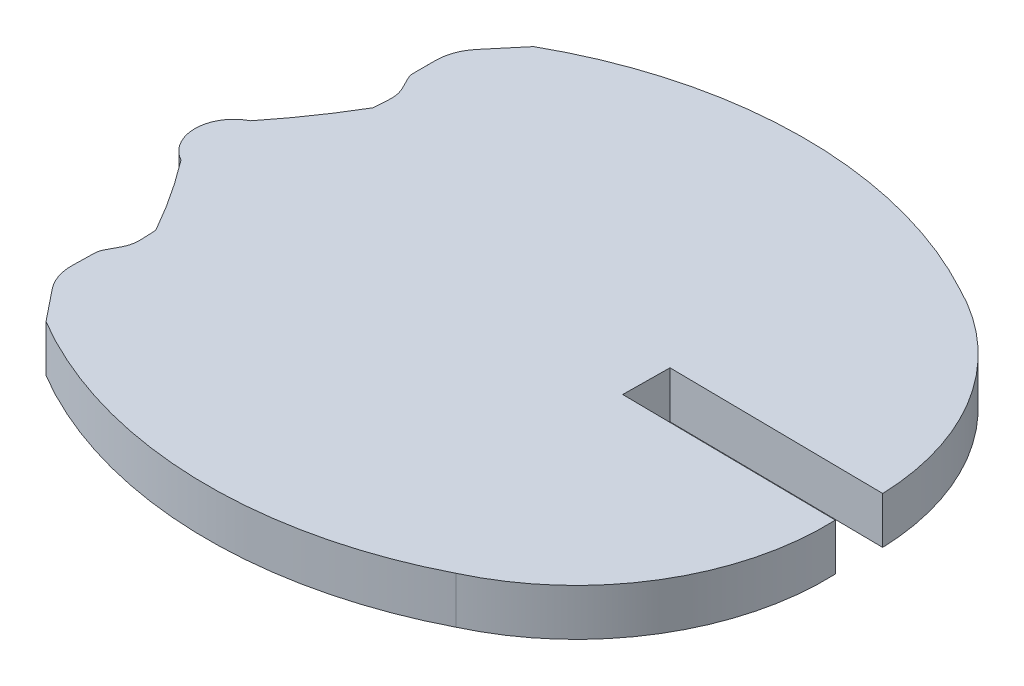
ISO-10303-21;
HEADER;
FILE_DESCRIPTION(('STEP AP214'),'2;1');
FILE_NAME('part.step','',(''),(''),'','','');
FILE_SCHEMA(('AUTOMOTIVE_DESIGN { 1 0 10303 214 1 1 1 1 }'));
ENDSEC;
DATA;
#1=APPLICATION_CONTEXT('core data for automotive mechanical design processes');
#2=APPLICATION_PROTOCOL_DEFINITION('international standard','automotive_design',2000,#1);
#3=PRODUCT_CONTEXT('',#1,'mechanical');
#4=PRODUCT('Part','Part','',(#3));
#5=PRODUCT_RELATED_PRODUCT_CATEGORY('part','',(#4));
#6=PRODUCT_DEFINITION_FORMATION('','',#4);
#7=PRODUCT_DEFINITION_CONTEXT('part definition',#1,'design');
#8=PRODUCT_DEFINITION('design','',#6,#7);
#9=PRODUCT_DEFINITION_SHAPE('','',#8);
#10=(LENGTH_UNIT() NAMED_UNIT(*) SI_UNIT(.MILLI.,.METRE.));
#11=(NAMED_UNIT(*) PLANE_ANGLE_UNIT() SI_UNIT($,.RADIAN.));
#12=(NAMED_UNIT(*) SI_UNIT($,.STERADIAN.) SOLID_ANGLE_UNIT());
#13=UNCERTAINTY_MEASURE_WITH_UNIT(LENGTH_MEASURE(1.E-05),#10,'distance_accuracy_value','');
#14=(GEOMETRIC_REPRESENTATION_CONTEXT(3) GLOBAL_UNCERTAINTY_ASSIGNED_CONTEXT((#13)) GLOBAL_UNIT_ASSIGNED_CONTEXT((#10,
#11,#12)) REPRESENTATION_CONTEXT('',''));
#15=CARTESIAN_POINT('',(0.,0.,0.));
#16=DIRECTION('',(0.,0.,1.));
#17=DIRECTION('',(1.,0.,0.));
#18=AXIS2_PLACEMENT_3D('',#15,#16,#17);
#19=CARTESIAN_POINT('',(-319.980883365397,2.,-506.984120103002));
#20=DIRECTION('',(0.,-1.,0.));
#21=DIRECTION('',(0.,0.,-1.));
#22=AXIS2_PLACEMENT_3D('',#19,#20,#21);
#23=CYLINDRICAL_SURFACE('',#22,18.7215126548);
#24=CARTESIAN_POINT('',(-319.980883365397,0.,-506.984120103002));
#25=DIRECTION('',(0.,1.,0.));
#26=DIRECTION('',(0.,0.,1.));
#27=AXIS2_PLACEMENT_3D('',#24,#25,#26);
#28=CIRCLE('',#27,18.7215126548);
#29=CARTESIAN_POINT('',(-329.52517,0.,-490.87817));
#30=VERTEX_POINT('',#29);
#31=CARTESIAN_POINT('',(-311.439430000059,0.,-490.324630000012));
#32=VERTEX_POINT('',#31);
#33=EDGE_CURVE('E11',#30,#32,#28,.T.);
#34=ORIENTED_EDGE('',*,*,#33,.T.);
#35=DIRECTION('',(0.,-1.,0.));
#36=VECTOR('',#35,1.);
#37=CARTESIAN_POINT('',(-311.439430000059,2.,-490.324630000012));
#38=LINE('',#37,#36);
#39=CARTESIAN_POINT('',(-311.439430000059,2.,-490.324630000012));
#40=VERTEX_POINT('',#39);
#41=EDGE_CURVE('E468',#40,#32,#38,.T.);
#42=ORIENTED_EDGE('',*,*,#41,.F.);
#43=CARTESIAN_POINT('',(-319.980883365397,2.,-506.984120103002));
#44=DIRECTION('',(0.,1.,0.));
#45=DIRECTION('',(0.,0.,1.));
#46=AXIS2_PLACEMENT_3D('',#43,#44,#45);
#47=CIRCLE('',#46,18.7215126548);
#48=CARTESIAN_POINT('',(-329.52517,2.,-490.87817));
#49=VERTEX_POINT('',#48);
#50=EDGE_CURVE('E41',#49,#40,#47,.T.);
#51=ORIENTED_EDGE('',*,*,#50,.F.);
#52=DIRECTION('',(0.,-1.,0.));
#53=VECTOR('',#52,1.);
#54=CARTESIAN_POINT('',(-329.52517,2.,-490.87817));
#55=LINE('',#54,#53);
#56=EDGE_CURVE('E237',#49,#30,#55,.T.);
#57=ORIENTED_EDGE('',*,*,#56,.T.);
#58=EDGE_LOOP('',(#34,#42,#51,#57));
#59=FACE_BOUND('',#58,.T.);
#60=ADVANCED_FACE('F37',(#59),#23,.T.);
#61=CARTESIAN_POINT('',(-315.957950868301,2.,-499.997998576027));
#62=DIRECTION('',(0.,-1.,0.));
#63=DIRECTION('',(0.,0.,-1.));
#64=AXIS2_PLACEMENT_3D('',#61,#62,#63);
#65=CYLINDRICAL_SURFACE('',#64,10.6766610157);
#66=CARTESIAN_POINT('',(-315.957950868301,0.,-499.997998576027));
#67=DIRECTION('',(0.,1.,0.));
#68=DIRECTION('',(0.,0.,1.));
#69=AXIS2_PLACEMENT_3D('',#66,#67,#68);
#70=CIRCLE('',#69,10.6766610157);
#71=CARTESIAN_POINT('',(-305.289269999968,0.,-500.410720000026));
#72=VERTEX_POINT('',#71);
#73=EDGE_CURVE('E47',#32,#72,#70,.T.);
#74=ORIENTED_EDGE('',*,*,#73,.T.);
#75=DIRECTION('',(0.,-1.,0.));
#76=VECTOR('',#75,1.);
#77=CARTESIAN_POINT('',(-305.289269999968,2.,-500.410720000026));
#78=LINE('',#77,#76);
#79=CARTESIAN_POINT('',(-305.289269999968,2.,-500.410720000026));
#80=VERTEX_POINT('',#79);
#81=EDGE_CURVE('E213',#80,#72,#78,.T.);
#82=ORIENTED_EDGE('',*,*,#81,.F.);
#83=CARTESIAN_POINT('',(-315.957950868301,2.,-499.997998576027));
#84=DIRECTION('',(0.,1.,0.));
#85=DIRECTION('',(0.,0.,1.));
#86=AXIS2_PLACEMENT_3D('',#83,#84,#85);
#87=CIRCLE('',#86,10.6766610157);
#88=EDGE_CURVE('E131',#40,#80,#87,.T.);
#89=ORIENTED_EDGE('',*,*,#88,.F.);
#90=ORIENTED_EDGE('',*,*,#41,.T.);
#91=EDGE_LOOP('',(#74,#82,#89,#90));
#92=FACE_BOUND('',#91,.T.);
#93=ADVANCED_FACE('F469',(#92),#65,.T.);
#94=CARTESIAN_POINT('',(-526.665515344915,2.,-502.95704711254));
#95=DIRECTION('',(-0.0115014991025592,0.,0.999933855571654));
#96=DIRECTION('',(0.999933855571654,0.,0.0115014991025592));
#97=AXIS2_PLACEMENT_3D('',#94,#95,#96);
#98=PLANE('',#97);
#99=DIRECTION('',(-0.999933855571654,0.,-0.0115014991025592));
#100=VECTOR('',#99,1.);
#101=CARTESIAN_POINT('',(-526.665515344915,0.,-502.95704711254));
#102=LINE('',#101,#100);
#103=CARTESIAN_POINT('',(-314.49094,0.,-500.51656));
#104=VERTEX_POINT('',#103);
#105=EDGE_CURVE('E207',#72,#104,#102,.T.);
#106=ORIENTED_EDGE('',*,*,#105,.T.);
#107=DIRECTION('',(0.,-1.,0.));
#108=VECTOR('',#107,1.);
#109=CARTESIAN_POINT('',(-314.49094,2.,-500.51656));
#110=LINE('',#109,#108);
#111=CARTESIAN_POINT('',(-314.49094,2.,-500.51656));
#112=VERTEX_POINT('',#111);
#113=EDGE_CURVE('E211',#112,#104,#110,.T.);
#114=ORIENTED_EDGE('',*,*,#113,.F.);
#115=DIRECTION('',(-0.999933855571654,0.,-0.0115014991025592));
#116=VECTOR('',#115,1.);
#117=CARTESIAN_POINT('',(-526.665515344915,2.,-502.95704711254));
#118=LINE('',#117,#116);
#119=EDGE_CURVE('E280',#80,#112,#118,.T.);
#120=ORIENTED_EDGE('',*,*,#119,.F.);
#121=ORIENTED_EDGE('',*,*,#81,.T.);
#122=EDGE_LOOP('',(#106,#114,#120,#121));
#123=FACE_BOUND('',#122,.T.);
#124=ADVANCED_FACE('F209',(#123),#98,.F.);
#125=CARTESIAN_POINT('',(-313.695227716964,2.,-569.704434933529));
#126=DIRECTION('',(-0.999933872962668,0.,-0.0114999870382514));
#127=DIRECTION('',(-0.0114999870382514,0.,0.999933872962668));
#128=AXIS2_PLACEMENT_3D('',#125,#126,#127);
#129=PLANE('',#128);
#130=DIRECTION('',(0.0114999870382514,0.,-0.999933872962668));
#131=VECTOR('',#130,1.);
#132=CARTESIAN_POINT('',(-313.695227716964,0.,-569.704434933529));
#133=LINE('',#132,#131);
#134=CARTESIAN_POINT('',(-314.467939999999,0.,-502.516430000049));
#135=VERTEX_POINT('',#134);
#136=EDGE_CURVE('E215',#104,#135,#133,.T.);
#137=ORIENTED_EDGE('',*,*,#136,.T.);
#138=DIRECTION('',(0.,-1.,0.));
#139=VECTOR('',#138,1.);
#140=CARTESIAN_POINT('',(-314.467939999999,2.,-502.516430000049));
#141=LINE('',#140,#139);
#142=CARTESIAN_POINT('',(-314.467939999999,2.,-502.516430000049));
#143=VERTEX_POINT('',#142);
#144=EDGE_CURVE('E222',#143,#135,#141,.T.);
#145=ORIENTED_EDGE('',*,*,#144,.F.);
#146=DIRECTION('',(0.0114999870382514,0.,-0.999933872962668));
#147=VECTOR('',#146,1.);
#148=CARTESIAN_POINT('',(-313.695227716964,2.,-569.704434933529));
#149=LINE('',#148,#147);
#150=EDGE_CURVE('E221',#112,#143,#149,.T.);
#151=ORIENTED_EDGE('',*,*,#150,.F.);
#152=ORIENTED_EDGE('',*,*,#113,.T.);
#153=EDGE_LOOP('',(#137,#145,#151,#152));
#154=FACE_BOUND('',#153,.T.);
#155=ADVANCED_FACE('F218',(#154),#129,.F.);
#156=CARTESIAN_POINT('',(-526.642595397857,2.,-504.95719031168));
#157=DIRECTION('',(0.0115027821222897,0.,-0.999933840813205));
#158=DIRECTION('',(-0.999933840813205,0.,-0.0115027821222897));
#159=AXIS2_PLACEMENT_3D('',#156,#157,#158);
#160=PLANE('',#159);
#161=DIRECTION('',(0.999933840813205,0.,0.0115027821222897));
#162=VECTOR('',#161,1.);
#163=CARTESIAN_POINT('',(-526.642595397857,0.,-504.95719031168));
#164=LINE('',#163,#162);
#165=CARTESIAN_POINT('',(-305.262949999882,0.,-502.410540000043));
#166=VERTEX_POINT('',#165);
#167=EDGE_CURVE('E227',#135,#166,#164,.T.);
#168=ORIENTED_EDGE('',*,*,#167,.T.);
#169=DIRECTION('',(0.,-1.,0.));
#170=VECTOR('',#169,1.);
#171=CARTESIAN_POINT('',(-305.262949999882,2.,-502.410540000043));
#172=LINE('',#171,#170);
#173=CARTESIAN_POINT('',(-305.262949999882,2.,-502.410540000043));
#174=VERTEX_POINT('',#173);
#175=EDGE_CURVE('E337',#174,#166,#172,.T.);
#176=ORIENTED_EDGE('',*,*,#175,.F.);
#177=DIRECTION('',(0.999933840813205,0.,0.0115027821222897));
#178=VECTOR('',#177,1.);
#179=CARTESIAN_POINT('',(-526.642595397857,2.,-504.95719031168));
#180=LINE('',#179,#178);
#181=EDGE_CURVE('E277',#143,#174,#180,.T.);
#182=ORIENTED_EDGE('',*,*,#181,.F.);
#183=ORIENTED_EDGE('',*,*,#144,.T.);
#184=EDGE_LOOP('',(#168,#176,#182,#183));
#185=FACE_BOUND('',#184,.T.);
#186=ADVANCED_FACE('F463',(#185),#160,.F.);
#187=CARTESIAN_POINT('',(-315.934140041034,2.,-502.068660064048));
#188=DIRECTION('',(0.,-1.,0.));
#189=DIRECTION('',(0.,0.,-1.));
#190=AXIS2_PLACEMENT_3D('',#187,#188,#189);
#191=CYLINDRICAL_SURFACE('',#190,10.6766651528);
#192=CARTESIAN_POINT('',(-315.934140041034,0.,-502.068660064048));
#193=DIRECTION('',(0.,1.,0.));
#194=DIRECTION('',(0.,0.,1.));
#195=AXIS2_PLACEMENT_3D('',#192,#193,#194);
#196=CIRCLE('',#195,10.6766651528);
#197=CARTESIAN_POINT('',(-311.194289999884,0.,-511.635530000052));
#198=VERTEX_POINT('',#197);
#199=EDGE_CURVE('E229',#166,#198,#196,.T.);
#200=ORIENTED_EDGE('',*,*,#199,.T.);
#201=DIRECTION('',(0.,-1.,0.));
#202=VECTOR('',#201,1.);
#203=CARTESIAN_POINT('',(-311.194289999884,2.,-511.635530000052));
#204=LINE('',#203,#202);
#205=CARTESIAN_POINT('',(-311.194289999884,2.,-511.635530000052));
#206=VERTEX_POINT('',#205);
#207=EDGE_CURVE('E334',#206,#198,#204,.T.);
#208=ORIENTED_EDGE('',*,*,#207,.F.);
#209=CARTESIAN_POINT('',(-315.934140041034,2.,-502.068660064048));
#210=DIRECTION('',(0.,1.,0.));
#211=DIRECTION('',(0.,0.,1.));
#212=AXIS2_PLACEMENT_3D('',#209,#210,#211);
#213=CIRCLE('',#212,10.6766651528);
#214=EDGE_CURVE('E275',#174,#206,#213,.T.);
#215=ORIENTED_EDGE('',*,*,#214,.F.);
#216=ORIENTED_EDGE('',*,*,#175,.T.);
#217=EDGE_LOOP('',(#200,#208,#215,#216));
#218=FACE_BOUND('',#217,.T.);
#219=ADVANCED_FACE('F332',(#218),#191,.T.);
#220=CARTESIAN_POINT('',(-320.116700314444,2.,-495.176929997642));
#221=DIRECTION('',(0.,-1.,0.));
#222=DIRECTION('',(0.,0.,-1.));
#223=AXIS2_PLACEMENT_3D('',#220,#221,#222);
#224=CYLINDRICAL_SURFACE('',#223,18.7215095508);
#225=CARTESIAN_POINT('',(-320.116700314444,0.,-495.176929997642));
#226=DIRECTION('',(0.,1.,0.));
#227=DIRECTION('',(0.,0.,1.));
#228=AXIS2_PLACEMENT_3D('',#225,#226,#227);
#229=CIRCLE('',#228,18.7215095508);
#230=CARTESIAN_POINT('',(-329.287979999896,0.,-511.498160000063));
#231=VERTEX_POINT('',#230);
#232=EDGE_CURVE('E327',#198,#231,#229,.T.);
#233=ORIENTED_EDGE('',*,*,#232,.T.);
#234=DIRECTION('',(0.,-1.,0.));
#235=VECTOR('',#234,1.);
#236=CARTESIAN_POINT('',(-329.287979999896,2.,-511.498160000063));
#237=LINE('',#236,#235);
#238=CARTESIAN_POINT('',(-329.287979999896,2.,-511.498160000063));
#239=VERTEX_POINT('',#238);
#240=EDGE_CURVE('E343',#239,#231,#237,.T.);
#241=ORIENTED_EDGE('',*,*,#240,.F.);
#242=CARTESIAN_POINT('',(-320.116700314444,2.,-495.176929997642));
#243=DIRECTION('',(0.,1.,0.));
#244=DIRECTION('',(0.,0.,1.));
#245=AXIS2_PLACEMENT_3D('',#242,#243,#244);
#246=CIRCLE('',#245,18.7215095508);
#247=EDGE_CURVE('E273',#206,#239,#246,.T.);
#248=ORIENTED_EDGE('',*,*,#247,.F.);
#249=ORIENTED_EDGE('',*,*,#207,.T.);
#250=EDGE_LOOP('',(#233,#241,#248,#249));
#251=FACE_BOUND('',#250,.T.);
#252=ADVANCED_FACE('F340',(#251),#224,.T.);
#253=CARTESIAN_POINT('',(-380.806401908728,2.,-450.208444366493));
#254=DIRECTION('',(0.765489159031569,0.,0.643448791595058));
#255=DIRECTION('',(0.643448791595058,0.,-0.765489159031569));
#256=AXIS2_PLACEMENT_3D('',#253,#254,#255);
#257=PLANE('',#256);
#258=DIRECTION('',(-0.643448791595058,0.,0.765489159031569));
#259=VECTOR('',#258,1.);
#260=CARTESIAN_POINT('',(-380.806401908728,0.,-450.208444366493));
#261=LINE('',#260,#259);
#262=CARTESIAN_POINT('',(-330.401199999934,0.,-510.173800000048));
#263=VERTEX_POINT('',#262);
#264=EDGE_CURVE('E325',#231,#263,#261,.T.);
#265=ORIENTED_EDGE('',*,*,#264,.T.);
#266=DIRECTION('',(0.,-1.,0.));
#267=VECTOR('',#266,1.);
#268=CARTESIAN_POINT('',(-330.401199999934,2.,-510.173800000048));
#269=LINE('',#268,#267);
#270=CARTESIAN_POINT('',(-330.401199999934,2.,-510.173800000048));
#271=VERTEX_POINT('',#270);
#272=EDGE_CURVE('E353',#271,#263,#269,.T.);
#273=ORIENTED_EDGE('',*,*,#272,.F.);
#274=DIRECTION('',(-0.643448791595058,0.,0.765489159031569));
#275=VECTOR('',#274,1.);
#276=CARTESIAN_POINT('',(-380.806401908728,2.,-450.208444366493));
#277=LINE('',#276,#275);
#278=EDGE_CURVE('E271',#239,#271,#277,.T.);
#279=ORIENTED_EDGE('',*,*,#278,.F.);
#280=ORIENTED_EDGE('',*,*,#240,.T.);
#281=EDGE_LOOP('',(#265,#273,#279,#280));
#282=FACE_BOUND('',#281,.T.);
#283=ADVANCED_FACE('F351',(#282),#257,.F.);
#284=CARTESIAN_POINT('',(-328.870207968434,2.,-508.886915574201));
#285=DIRECTION('',(0.,-1.,0.));
#286=DIRECTION('',(0.,0.,-1.));
#287=AXIS2_PLACEMENT_3D('',#284,#285,#286);
#288=CYLINDRICAL_SURFACE('',#287,2.00000203150001);
#289=CARTESIAN_POINT('',(-328.870207968434,0.,-508.886915574201));
#290=DIRECTION('',(0.,1.,0.));
#291=DIRECTION('',(0.,0.,1.));
#292=AXIS2_PLACEMENT_3D('',#289,#290,#291);
#293=CIRCLE('',#292,2.00000203150001);
#294=CARTESIAN_POINT('',(-330.870209999926,0.,-508.886910000011));
#295=VERTEX_POINT('',#294);
#296=EDGE_CURVE('E323',#263,#295,#293,.T.);
#297=ORIENTED_EDGE('',*,*,#296,.T.);
#298=DIRECTION('',(0.,-1.,0.));
#299=VECTOR('',#298,1.);
#300=CARTESIAN_POINT('',(-330.870209999926,2.,-508.886910000011));
#301=LINE('',#300,#299);
#302=CARTESIAN_POINT('',(-330.870209999926,2.,-508.886910000011));
#303=VERTEX_POINT('',#302);
#304=EDGE_CURVE('E359',#303,#295,#301,.T.);
#305=ORIENTED_EDGE('',*,*,#304,.F.);
#306=CARTESIAN_POINT('',(-328.870207968434,2.,-508.886915574201));
#307=DIRECTION('',(0.,1.,0.));
#308=DIRECTION('',(0.,0.,1.));
#309=AXIS2_PLACEMENT_3D('',#306,#307,#308);
#310=CIRCLE('',#309,2.00000203150001);
#311=EDGE_CURVE('E269',#271,#303,#310,.T.);
#312=ORIENTED_EDGE('',*,*,#311,.F.);
#313=ORIENTED_EDGE('',*,*,#272,.T.);
#314=EDGE_LOOP('',(#297,#305,#312,#313));
#315=FACE_BOUND('',#314,.T.);
#316=ADVANCED_FACE('F356',(#315),#288,.T.);
#317=CARTESIAN_POINT('',(-330.870209999926,2.,-572.1446));
#318=DIRECTION('',(1.,0.,0.));
#319=DIRECTION('',(0.,0.,-1.));
#320=AXIS2_PLACEMENT_3D('',#317,#318,#319);
#321=PLANE('',#320);
#322=DIRECTION('',(0.,0.,1.));
#323=VECTOR('',#322,1.);
#324=CARTESIAN_POINT('',(-330.870209999926,0.,-572.1446));
#325=LINE('',#324,#323);
#326=CARTESIAN_POINT('',(-330.870209999926,0.,-507.943050000048));
#327=VERTEX_POINT('',#326);
#328=EDGE_CURVE('E321',#295,#327,#325,.T.);
#329=ORIENTED_EDGE('',*,*,#328,.T.);
#330=DIRECTION('',(0.,-1.,0.));
#331=VECTOR('',#330,1.);
#332=CARTESIAN_POINT('',(-330.870209999926,2.,-507.943050000048));
#333=LINE('',#332,#331);
#334=CARTESIAN_POINT('',(-330.870209999926,2.,-507.943050000048));
#335=VERTEX_POINT('',#334);
#336=EDGE_CURVE('E361',#335,#327,#333,.T.);
#337=ORIENTED_EDGE('',*,*,#336,.F.);
#338=DIRECTION('',(0.,0.,1.));
#339=VECTOR('',#338,1.);
#340=CARTESIAN_POINT('',(-330.870209999926,2.,-572.1446));
#341=LINE('',#340,#339);
#342=EDGE_CURVE('E267',#303,#335,#341,.T.);
#343=ORIENTED_EDGE('',*,*,#342,.F.);
#344=ORIENTED_EDGE('',*,*,#304,.T.);
#345=EDGE_LOOP('',(#329,#337,#343,#344));
#346=FACE_BOUND('',#345,.T.);
#347=ADVANCED_FACE('F460',(#346),#321,.F.);
#348=CARTESIAN_POINT('',(-330.20355158136,2.,-507.943056697515));
#349=DIRECTION('',(0.,-1.,0.));
#350=DIRECTION('',(0.,0.,-1.));
#351=AXIS2_PLACEMENT_3D('',#348,#349,#350);
#352=CYLINDRICAL_SURFACE('',#351,0.666658418599986);
#353=CARTESIAN_POINT('',(-330.20355158136,0.,-507.943056697515));
#354=DIRECTION('',(0.,1.,0.));
#355=DIRECTION('',(0.,0.,1.));
#356=AXIS2_PLACEMENT_3D('',#353,#354,#355);
#357=CIRCLE('',#356,0.666658418599986);
#358=CARTESIAN_POINT('',(-330.799799999989,0.,-507.644860000062));
#359=VERTEX_POINT('',#358);
#360=EDGE_CURVE('E319',#327,#359,#357,.T.);
#361=ORIENTED_EDGE('',*,*,#360,.T.);
#362=DIRECTION('',(0.,-1.,0.));
#363=VECTOR('',#362,1.);
#364=CARTESIAN_POINT('',(-330.799799999989,2.,-507.644860000062));
#365=LINE('',#364,#363);
#366=CARTESIAN_POINT('',(-330.799799999989,2.,-507.644860000062));
#367=VERTEX_POINT('',#366);
#368=EDGE_CURVE('E367',#367,#359,#365,.T.);
#369=ORIENTED_EDGE('',*,*,#368,.F.);
#370=CARTESIAN_POINT('',(-330.20355158136,2.,-507.943056697515));
#371=DIRECTION('',(0.,1.,0.));
#372=DIRECTION('',(0.,0.,1.));
#373=AXIS2_PLACEMENT_3D('',#370,#371,#372);
#374=CIRCLE('',#373,0.666658418599986);
#375=EDGE_CURVE('E265',#335,#367,#374,.T.);
#376=ORIENTED_EDGE('',*,*,#375,.F.);
#377=ORIENTED_EDGE('',*,*,#336,.T.);
#378=EDGE_LOOP('',(#361,#369,#376,#377));
#379=FACE_BOUND('',#378,.T.);
#380=ADVANCED_FACE('F455',(#379),#352,.T.);
#381=CARTESIAN_POINT('',(-395.630881112301,2.,-637.278392306967));
#382=DIRECTION('',(0.894387681920329,0.,-0.447292604934601));
#383=DIRECTION('',(-0.447292604934601,0.,-0.894387681920329));
#384=AXIS2_PLACEMENT_3D('',#381,#382,#383);
#385=PLANE('',#384);
#386=DIRECTION('',(0.447292604934601,0.,0.894387681920329));
#387=VECTOR('',#386,1.);
#388=CARTESIAN_POINT('',(-395.630881112301,0.,-637.278392306967));
#389=LINE('',#388,#387);
#390=CARTESIAN_POINT('',(-330.550709999926,0.,-507.146790000048));
#391=VERTEX_POINT('',#390);
#392=EDGE_CURVE('E316',#359,#391,#389,.T.);
#393=ORIENTED_EDGE('',*,*,#392,.T.);
#394=DIRECTION('',(0.,-1.,0.));
#395=VECTOR('',#394,1.);
#396=CARTESIAN_POINT('',(-330.550709999926,2.,-507.146790000048));
#397=LINE('',#396,#395);
#398=CARTESIAN_POINT('',(-330.550709999926,2.,-507.146790000048));
#399=VERTEX_POINT('',#398);
#400=EDGE_CURVE('E370',#399,#391,#397,.T.);
#401=ORIENTED_EDGE('',*,*,#400,.F.);
#402=DIRECTION('',(0.447292604934601,0.,0.894387681920329));
#403=VECTOR('',#402,1.);
#404=CARTESIAN_POINT('',(-395.630881112301,2.,-637.278392306967));
#405=LINE('',#404,#403);
#406=EDGE_CURVE('E263',#367,#399,#405,.T.);
#407=ORIENTED_EDGE('',*,*,#406,.F.);
#408=ORIENTED_EDGE('',*,*,#368,.T.);
#409=EDGE_LOOP('',(#393,#401,#407,#408));
#410=FACE_BOUND('',#409,.T.);
#411=ADVANCED_FACE('F451',(#410),#385,.F.);
#412=CARTESIAN_POINT('',(-331.743232898868,2.,-506.550414404527));
#413=DIRECTION('',(0.,-1.,0.));
#414=DIRECTION('',(0.,0.,-1.));
#415=AXIS2_PLACEMENT_3D('',#412,#413,#414);
#416=CYLINDRICAL_SURFACE('',#415,1.33333218495353);
#417=CARTESIAN_POINT('',(-331.743232898868,0.,-506.550414404527));
#418=DIRECTION('',(0.,1.,0.));
#419=DIRECTION('',(0.,0.,1.));
#420=AXIS2_PLACEMENT_3D('',#417,#418,#419);
#421=CIRCLE('',#420,1.33333218495353);
#422=CARTESIAN_POINT('',(-330.412849999933,0.,-506.461780000062));
#423=VERTEX_POINT('',#422);
#424=EDGE_CURVE('E313',#423,#391,#421,.T.);
#425=ORIENTED_EDGE('',*,*,#424,.F.);
#426=DIRECTION('',(0.,-1.,0.));
#427=VECTOR('',#426,1.);
#428=CARTESIAN_POINT('',(-330.412849999933,2.,-506.461780000062));
#429=LINE('',#428,#427);
#430=CARTESIAN_POINT('',(-330.412849999933,2.,-506.461780000062));
#431=VERTEX_POINT('',#430);
#432=EDGE_CURVE('E372',#431,#423,#429,.T.);
#433=ORIENTED_EDGE('',*,*,#432,.F.);
#434=CARTESIAN_POINT('',(-331.743232898868,2.,-506.550414404527));
#435=DIRECTION('',(0.,1.,0.));
#436=DIRECTION('',(0.,0.,1.));
#437=AXIS2_PLACEMENT_3D('',#434,#435,#436);
#438=CIRCLE('',#437,1.33333218495353);
#439=EDGE_CURVE('E260',#431,#399,#438,.T.);
#440=ORIENTED_EDGE('',*,*,#439,.T.);
#441=ORIENTED_EDGE('',*,*,#400,.T.);
#442=EDGE_LOOP('',(#425,#433,#440,#441));
#443=FACE_BOUND('',#442,.T.);
#444=ADVANCED_FACE('F446',(#443),#416,.F.);
#445=CARTESIAN_POINT('',(-326.920784633722,2.,-558.894401967546));
#446=DIRECTION('',(0.997789504105283,0.,0.0664537846727523));
#447=DIRECTION('',(0.0664537846727523,0.,-0.997789504105284));
#448=AXIS2_PLACEMENT_3D('',#445,#446,#447);
#449=PLANE('',#448);
#450=DIRECTION('',(-0.0664537846727523,0.,0.997789504105283));
#451=VECTOR('',#450,1.);
#452=CARTESIAN_POINT('',(-326.920784633722,0.,-558.894401967546));
#453=LINE('',#452,#451);
#454=CARTESIAN_POINT('',(-330.457480000014,0.,-505.79167000003));
#455=VERTEX_POINT('',#454);
#456=EDGE_CURVE('E310',#423,#455,#453,.T.);
#457=ORIENTED_EDGE('',*,*,#456,.T.);
#458=DIRECTION('',(0.,-1.,0.));
#459=VECTOR('',#458,1.);
#460=CARTESIAN_POINT('',(-330.457480000014,2.,-505.79167000003));
#461=LINE('',#460,#459);
#462=CARTESIAN_POINT('',(-330.457480000014,2.,-505.79167000003));
#463=VERTEX_POINT('',#462);
#464=EDGE_CURVE('E374',#463,#455,#461,.T.);
#465=ORIENTED_EDGE('',*,*,#464,.F.);
#466=DIRECTION('',(-0.0664537846727523,0.,0.997789504105283));
#467=VECTOR('',#466,1.);
#468=CARTESIAN_POINT('',(-326.920784633722,2.,-558.894401967546));
#469=LINE('',#468,#467);
#470=EDGE_CURVE('E258',#431,#463,#469,.T.);
#471=ORIENTED_EDGE('',*,*,#470,.F.);
#472=ORIENTED_EDGE('',*,*,#432,.T.);
#473=EDGE_LOOP('',(#457,#465,#471,#472));
#474=FACE_BOUND('',#473,.T.);
#475=ADVANCED_FACE('F442',(#474),#449,.F.);
#476=CARTESIAN_POINT('',(-353.071706831118,2.,-519.097200089332));
#477=DIRECTION('',(0.,-1.,0.));
#478=DIRECTION('',(0.,0.,-1.));
#479=AXIS2_PLACEMENT_3D('',#476,#477,#478);
#480=CYLINDRICAL_SURFACE('',#479,26.2381475360958);
#481=CARTESIAN_POINT('',(-353.071706831118,0.,-519.097200089332));
#482=DIRECTION('',(0.,1.,0.));
#483=DIRECTION('',(0.,0.,1.));
#484=AXIS2_PLACEMENT_3D('',#481,#482,#483);
#485=CIRCLE('',#484,26.2381475360958);
#486=CARTESIAN_POINT('',(-332.589830000022,0.,-502.698020000018));
#487=VERTEX_POINT('',#486);
#488=EDGE_CURVE('E307',#487,#455,#485,.T.);
#489=ORIENTED_EDGE('',*,*,#488,.F.);
#490=DIRECTION('',(0.,-1.,0.));
#491=VECTOR('',#490,1.);
#492=CARTESIAN_POINT('',(-332.589830000022,2.,-502.698020000018));
#493=LINE('',#492,#491);
#494=CARTESIAN_POINT('',(-332.589830000022,2.,-502.698020000018));
#495=VERTEX_POINT('',#494);
#496=EDGE_CURVE('E376',#495,#487,#493,.T.);
#497=ORIENTED_EDGE('',*,*,#496,.F.);
#498=CARTESIAN_POINT('',(-353.071706831118,2.,-519.097200089332));
#499=DIRECTION('',(0.,1.,0.));
#500=DIRECTION('',(0.,0.,1.));
#501=AXIS2_PLACEMENT_3D('',#498,#499,#500);
#502=CIRCLE('',#501,26.2381475360958);
#503=EDGE_CURVE('E255',#495,#463,#502,.T.);
#504=ORIENTED_EDGE('',*,*,#503,.T.);
#505=ORIENTED_EDGE('',*,*,#464,.T.);
#506=EDGE_LOOP('',(#489,#497,#504,#505));
#507=FACE_BOUND('',#506,.T.);
#508=ADVANCED_FACE('F437',(#507),#480,.F.);
#509=CARTESIAN_POINT('',(-331.827309959864,2.,-501.216013485104));
#510=DIRECTION('',(0.,-1.,0.));
#511=DIRECTION('',(0.,0.,-1.));
#512=AXIS2_PLACEMENT_3D('',#509,#510,#511);
#513=CYLINDRICAL_SURFACE('',#512,1.66666736989995);
#514=CARTESIAN_POINT('',(-331.827309959864,0.,-501.216013485104));
#515=DIRECTION('',(0.,1.,0.));
#516=DIRECTION('',(0.,0.,1.));
#517=AXIS2_PLACEMENT_3D('',#514,#515,#516);
#518=CIRCLE('',#517,1.66666736989995);
#519=CARTESIAN_POINT('',(-332.623720000032,0.,-499.751939999992));
#520=VERTEX_POINT('',#519);
#521=EDGE_CURVE('E304',#487,#520,#518,.T.);
#522=ORIENTED_EDGE('',*,*,#521,.T.);
#523=DIRECTION('',(0.,-1.,0.));
#524=VECTOR('',#523,1.);
#525=CARTESIAN_POINT('',(-332.623720000032,2.,-499.751939999992));
#526=LINE('',#525,#524);
#527=CARTESIAN_POINT('',(-332.623720000032,2.,-499.751939999992));
#528=VERTEX_POINT('',#527);
#529=EDGE_CURVE('E378',#528,#520,#526,.T.);
#530=ORIENTED_EDGE('',*,*,#529,.F.);
#531=CARTESIAN_POINT('',(-331.827309959864,2.,-501.216013485104));
#532=DIRECTION('',(0.,1.,0.));
#533=DIRECTION('',(0.,0.,1.));
#534=AXIS2_PLACEMENT_3D('',#531,#532,#533);
#535=CIRCLE('',#534,1.66666736989995);
#536=EDGE_CURVE('E253',#495,#528,#535,.T.);
#537=ORIENTED_EDGE('',*,*,#536,.F.);
#538=ORIENTED_EDGE('',*,*,#496,.T.);
#539=EDGE_LOOP('',(#522,#530,#537,#538));
#540=FACE_BOUND('',#539,.T.);
#541=ADVANCED_FACE('F433',(#540),#513,.T.);
#542=CARTESIAN_POINT('',(-353.477406660037,2.,-483.828255402022));
#543=DIRECTION('',(0.,-1.,0.));
#544=DIRECTION('',(0.,0.,-1.));
#545=AXIS2_PLACEMENT_3D('',#542,#543,#544);
#546=CYLINDRICAL_SURFACE('',#545,26.2381397680795);
#547=CARTESIAN_POINT('',(-353.477406660037,0.,-483.828255402022));
#548=DIRECTION('',(0.,1.,0.));
#549=DIRECTION('',(0.,0.,1.));
#550=AXIS2_PLACEMENT_3D('',#547,#548,#549);
#551=CIRCLE('',#550,26.2381397680795);
#552=CARTESIAN_POINT('',(-330.563100000044,0.,-496.610060000007));
#553=VERTEX_POINT('',#552);
#554=EDGE_CURVE('E301',#553,#520,#551,.T.);
#555=ORIENTED_EDGE('',*,*,#554,.F.);
#556=DIRECTION('',(0.,-1.,0.));
#557=VECTOR('',#556,1.);
#558=CARTESIAN_POINT('',(-330.563100000044,2.,-496.610060000007));
#559=LINE('',#558,#557);
#560=CARTESIAN_POINT('',(-330.563100000044,2.,-496.610060000007));
#561=VERTEX_POINT('',#560);
#562=EDGE_CURVE('E380',#561,#553,#559,.T.);
#563=ORIENTED_EDGE('',*,*,#562,.F.);
#564=CARTESIAN_POINT('',(-353.477406660037,2.,-483.828255402022));
#565=DIRECTION('',(0.,1.,0.));
#566=DIRECTION('',(0.,0.,1.));
#567=AXIS2_PLACEMENT_3D('',#564,#565,#566);
#568=CIRCLE('',#567,26.2381397680795);
#569=EDGE_CURVE('E250',#561,#528,#568,.T.);
#570=ORIENTED_EDGE('',*,*,#569,.T.);
#571=ORIENTED_EDGE('',*,*,#529,.T.);
#572=EDGE_LOOP('',(#555,#563,#570,#571));
#573=FACE_BOUND('',#572,.T.);
#574=ADVANCED_FACE('F428',(#573),#546,.F.);
#575=CARTESIAN_POINT('',(-334.214705706418,2.,-580.488230683507));
#576=DIRECTION('',(0.999053712580594,0.,-0.0434934406426099));
#577=DIRECTION('',(-0.0434934406426099,0.,-0.999053712580594));
#578=AXIS2_PLACEMENT_3D('',#575,#576,#577);
#579=PLANE('',#578);
#580=DIRECTION('',(0.0434934406426099,0.,0.999053712580594));
#581=VECTOR('',#580,1.);
#582=CARTESIAN_POINT('',(-334.214705706418,0.,-580.488230683507));
#583=LINE('',#582,#581);
#584=CARTESIAN_POINT('',(-330.533890000055,0.,-495.939100000013));
#585=VERTEX_POINT('',#584);
#586=EDGE_CURVE('E298',#553,#585,#583,.T.);
#587=ORIENTED_EDGE('',*,*,#586,.T.);
#588=DIRECTION('',(0.,-1.,0.));
#589=VECTOR('',#588,1.);
#590=CARTESIAN_POINT('',(-330.533890000055,2.,-495.939100000013));
#591=LINE('',#590,#589);
#592=CARTESIAN_POINT('',(-330.533890000055,2.,-495.939100000013));
#593=VERTEX_POINT('',#592);
#594=EDGE_CURVE('E382',#593,#585,#591,.T.);
#595=ORIENTED_EDGE('',*,*,#594,.F.);
#596=DIRECTION('',(0.0434934406426099,0.,0.999053712580594));
#597=VECTOR('',#596,1.);
#598=CARTESIAN_POINT('',(-334.214705706418,2.,-580.488230683507));
#599=LINE('',#598,#597);
#600=EDGE_CURVE('E248',#561,#593,#599,.T.);
#601=ORIENTED_EDGE('',*,*,#600,.F.);
#602=ORIENTED_EDGE('',*,*,#562,.T.);
#603=EDGE_LOOP('',(#587,#595,#601,#602));
#604=FACE_BOUND('',#603,.T.);
#605=ADVANCED_FACE('F424',(#604),#579,.F.);
#606=CARTESIAN_POINT('',(-331.865960952326,2.,-495.881105773714));
#607=DIRECTION('',(0.,-1.,0.));
#608=DIRECTION('',(0.,0.,-1.));
#609=AXIS2_PLACEMENT_3D('',#606,#607,#608);
#610=CYLINDRICAL_SURFACE('',#609,1.33333279872934);
#611=CARTESIAN_POINT('',(-331.865960952326,0.,-495.881105773714));
#612=DIRECTION('',(0.,1.,0.));
#613=DIRECTION('',(0.,0.,1.));
#614=AXIS2_PLACEMENT_3D('',#611,#612,#613);
#615=CIRCLE('',#614,1.33333279872934);
#616=CARTESIAN_POINT('',(-330.687480000057,0.,-495.257439999997));
#617=VERTEX_POINT('',#616);
#618=EDGE_CURVE('E295',#617,#585,#615,.T.);
#619=ORIENTED_EDGE('',*,*,#618,.F.);
#620=DIRECTION('',(0.,-1.,0.));
#621=VECTOR('',#620,1.);
#622=CARTESIAN_POINT('',(-330.687480000057,2.,-495.257439999997));
#623=LINE('',#622,#621);
#624=CARTESIAN_POINT('',(-330.687480000057,2.,-495.257439999997));
#625=VERTEX_POINT('',#624);
#626=EDGE_CURVE('E384',#625,#617,#623,.T.);
#627=ORIENTED_EDGE('',*,*,#626,.F.);
#628=CARTESIAN_POINT('',(-331.865960952326,2.,-495.881105773714));
#629=DIRECTION('',(0.,1.,0.));
#630=DIRECTION('',(0.,0.,1.));
#631=AXIS2_PLACEMENT_3D('',#628,#629,#630);
#632=CIRCLE('',#631,1.33333279872934);
#633=EDGE_CURVE('E245',#625,#593,#632,.T.);
#634=ORIENTED_EDGE('',*,*,#633,.T.);
#635=ORIENTED_EDGE('',*,*,#594,.T.);
#636=EDGE_LOOP('',(#619,#627,#634,#635));
#637=FACE_BOUND('',#636,.T.);
#638=ADVANCED_FACE('F418',(#637),#610,.F.);
#639=CARTESIAN_POINT('',(-341.603596603088,2.,-474.630053043952));
#640=DIRECTION('',(0.883863470027815,0.,0.467744980037617));
#641=DIRECTION('',(0.467744980037617,0.,-0.883863470027815));
#642=AXIS2_PLACEMENT_3D('',#639,#640,#641);
#643=PLANE('',#642);
#644=DIRECTION('',(-0.467744980037617,0.,0.883863470027815));
#645=VECTOR('',#644,1.);
#646=CARTESIAN_POINT('',(-341.603596603088,0.,-474.630053043952));
#647=LINE('',#646,#645);
#648=CARTESIAN_POINT('',(-330.94796,0.,-494.76523));
#649=VERTEX_POINT('',#648);
#650=EDGE_CURVE('E293',#617,#649,#647,.T.);
#651=ORIENTED_EDGE('',*,*,#650,.T.);
#652=DIRECTION('',(0.,-1.,0.));
#653=VECTOR('',#652,1.);
#654=CARTESIAN_POINT('',(-330.94796,2.,-494.76523));
#655=LINE('',#654,#653);
#656=CARTESIAN_POINT('',(-330.94796,2.,-494.76523));
#657=VERTEX_POINT('',#656);
#658=EDGE_CURVE('E386',#657,#649,#655,.T.);
#659=ORIENTED_EDGE('',*,*,#658,.F.);
#660=DIRECTION('',(-0.467744980037617,0.,0.883863470027815));
#661=VECTOR('',#660,1.);
#662=CARTESIAN_POINT('',(-341.603596603088,2.,-474.630053043952));
#663=LINE('',#662,#661);
#664=EDGE_CURVE('E243',#625,#657,#663,.T.);
#665=ORIENTED_EDGE('',*,*,#664,.F.);
#666=ORIENTED_EDGE('',*,*,#626,.T.);
#667=EDGE_LOOP('',(#651,#659,#665,#666));
#668=FACE_BOUND('',#667,.T.);
#669=ADVANCED_FACE('F511',(#668),#643,.F.);
#670=CARTESIAN_POINT('',(-330.358721032397,2.,-494.45339603764));
#671=DIRECTION('',(0.,-1.,0.));
#672=DIRECTION('',(0.,0.,-1.));
#673=AXIS2_PLACEMENT_3D('',#670,#671,#672);
#674=CYLINDRICAL_SURFACE('',#673,0.666665569100024);
#675=CARTESIAN_POINT('',(-330.358721032397,0.,-494.45339603764));
#676=DIRECTION('',(0.,1.,0.));
#677=DIRECTION('',(0.,0.,1.));
#678=AXIS2_PLACEMENT_3D('',#675,#676,#677);
#679=CIRCLE('',#678,0.666665569100024);
#680=CARTESIAN_POINT('',(-331.025209999929,0.,-494.468740000011));
#681=VERTEX_POINT('',#680);
#682=EDGE_CURVE('E291',#649,#681,#679,.T.);
#683=ORIENTED_EDGE('',*,*,#682,.T.);
#684=DIRECTION('',(0.,-1.,0.));
#685=VECTOR('',#684,1.);
#686=CARTESIAN_POINT('',(-331.025209999929,2.,-494.468740000011));
#687=LINE('',#686,#685);
#688=CARTESIAN_POINT('',(-331.025209999929,2.,-494.468740000011));
#689=VERTEX_POINT('',#688);
#690=EDGE_CURVE('E389',#689,#681,#687,.T.);
#691=ORIENTED_EDGE('',*,*,#690,.F.);
#692=CARTESIAN_POINT('',(-330.358721032397,2.,-494.45339603764));
#693=DIRECTION('',(0.,1.,0.));
#694=DIRECTION('',(0.,0.,1.));
#695=AXIS2_PLACEMENT_3D('',#692,#693,#694);
#696=CIRCLE('',#695,0.666665569100024);
#697=EDGE_CURVE('E241',#657,#689,#696,.T.);
#698=ORIENTED_EDGE('',*,*,#697,.F.);
#699=ORIENTED_EDGE('',*,*,#658,.T.);
#700=EDGE_LOOP('',(#683,#691,#698,#699));
#701=FACE_BOUND('',#700,.T.);
#702=ADVANCED_FACE('F411',(#701),#674,.T.);
#703=CARTESIAN_POINT('',(-329.34212133715,2.,-567.623013970926));
#704=DIRECTION('',(0.999735435109812,0.,0.0230012996544915));
#705=DIRECTION('',(0.0230012996544915,0.,-0.999735435109812));
#706=AXIS2_PLACEMENT_3D('',#703,#704,#705);
#707=PLANE('',#706);
#708=DIRECTION('',(-0.0230012996544915,0.,0.999735435109812));
#709=VECTOR('',#708,1.);
#710=CARTESIAN_POINT('',(-329.34212133715,0.,-567.623013970926));
#711=LINE('',#710,#709);
#712=CARTESIAN_POINT('',(-331.04692,0.,-493.52513));
#713=VERTEX_POINT('',#712);
#714=EDGE_CURVE('E285',#681,#713,#711,.T.);
#715=ORIENTED_EDGE('',*,*,#714,.T.);
#716=DIRECTION('',(0.,-1.,0.));
#717=VECTOR('',#716,1.);
#718=CARTESIAN_POINT('',(-331.04692,2.,-493.52513));
#719=LINE('',#718,#717);
#720=CARTESIAN_POINT('',(-331.04692,2.,-493.52513));
#721=VERTEX_POINT('',#720);
#722=EDGE_CURVE('E392',#721,#713,#719,.T.);
#723=ORIENTED_EDGE('',*,*,#722,.F.);
#724=DIRECTION('',(-0.0230012996544915,0.,0.999735435109812));
#725=VECTOR('',#724,1.);
#726=CARTESIAN_POINT('',(-329.34212133715,2.,-567.623013970926));
#727=LINE('',#726,#725);
#728=EDGE_CURVE('E239',#689,#721,#727,.T.);
#729=ORIENTED_EDGE('',*,*,#728,.F.);
#730=ORIENTED_EDGE('',*,*,#690,.T.);
#731=EDGE_LOOP('',(#715,#723,#729,#730));
#732=FACE_BOUND('',#731,.T.);
#733=ADVANCED_FACE('F407',(#732),#707,.F.);
#734=CARTESIAN_POINT('',(-329.047451030229,2.,-493.479123042636));
#735=DIRECTION('',(0.,-1.,0.));
#736=DIRECTION('',(0.,0.,-1.));
#737=AXIS2_PLACEMENT_3D('',#734,#735,#736);
#738=CYLINDRICAL_SURFACE('',#737,1.99999820029998);
#739=CARTESIAN_POINT('',(-329.047451030229,0.,-493.479123042636));
#740=DIRECTION('',(0.,1.,0.));
#741=DIRECTION('',(0.,0.,1.));
#742=AXIS2_PLACEMENT_3D('',#739,#740,#741);
#743=CIRCLE('',#742,1.99999820029998);
#744=CARTESIAN_POINT('',(-330.607629999967,0.,-492.227790000001));
#745=VERTEX_POINT('',#744);
#746=EDGE_CURVE('E283',#713,#745,#743,.T.);
#747=ORIENTED_EDGE('',*,*,#746,.T.);
#748=DIRECTION('',(0.,-1.,0.));
#749=VECTOR('',#748,1.);
#750=CARTESIAN_POINT('',(-330.607629999967,2.,-492.227790000001));
#751=LINE('',#750,#749);
#752=CARTESIAN_POINT('',(-330.607629999967,2.,-492.227790000001));
#753=VERTEX_POINT('',#752);
#754=EDGE_CURVE('E394',#753,#745,#751,.T.);
#755=ORIENTED_EDGE('',*,*,#754,.F.);
#756=CARTESIAN_POINT('',(-329.047451030229,2.,-493.479123042636));
#757=DIRECTION('',(0.,1.,0.));
#758=DIRECTION('',(0.,0.,1.));
#759=AXIS2_PLACEMENT_3D('',#756,#757,#758);
#760=CIRCLE('',#759,1.99999820029998);
#761=EDGE_CURVE('E236',#721,#753,#760,.T.);
#762=ORIENTED_EDGE('',*,*,#761,.F.);
#763=ORIENTED_EDGE('',*,*,#722,.T.);
#764=EDGE_LOOP('',(#747,#755,#762,#763));
#765=FACE_BOUND('',#764,.T.);
#766=ADVANCED_FACE('F402',(#765),#738,.T.);
#767=CARTESIAN_POINT('',(-446.050755573327,2.,-636.16322515805));
#768=DIRECTION('',(0.780088880131085,0.,-0.625668713534431));
#769=DIRECTION('',(-0.625668713534431,0.,-0.780088880131085));
#770=AXIS2_PLACEMENT_3D('',#767,#768,#769);
#771=PLANE('',#770);
#772=DIRECTION('',(0.625668713534431,0.,0.780088880131085));
#773=VECTOR('',#772,1.);
#774=CARTESIAN_POINT('',(-446.050755573327,0.,-636.16322515805));
#775=LINE('',#774,#773);
#776=EDGE_CURVE('E142',#745,#30,#775,.T.);
#777=ORIENTED_EDGE('',*,*,#776,.T.);
#778=ORIENTED_EDGE('',*,*,#56,.F.);
#779=DIRECTION('',(0.625668713534431,0.,0.780088880131085));
#780=VECTOR('',#779,1.);
#781=CARTESIAN_POINT('',(-446.050755573327,2.,-636.16322515805));
#782=LINE('',#781,#780);
#783=EDGE_CURVE('E234',#753,#49,#782,.T.);
#784=ORIENTED_EDGE('',*,*,#783,.F.);
#785=ORIENTED_EDGE('',*,*,#754,.T.);
#786=EDGE_LOOP('',(#777,#778,#784,#785));
#787=FACE_BOUND('',#786,.T.);
#788=ADVANCED_FACE('F520',(#787),#771,.F.);
#789=CARTESIAN_POINT('',(-525.869702128861,2.,-572.1446));
#790=DIRECTION('',(0.,1.,0.));
#791=DIRECTION('',(0.,0.,1.));
#792=AXIS2_PLACEMENT_3D('',#789,#790,#791);
#793=PLANE('',#792);
#794=ORIENTED_EDGE('',*,*,#50,.T.);
#795=ORIENTED_EDGE('',*,*,#88,.T.);
#796=ORIENTED_EDGE('',*,*,#119,.T.);
#797=ORIENTED_EDGE('',*,*,#150,.T.);
#798=ORIENTED_EDGE('',*,*,#181,.T.);
#799=ORIENTED_EDGE('',*,*,#214,.T.);
#800=ORIENTED_EDGE('',*,*,#247,.T.);
#801=ORIENTED_EDGE('',*,*,#278,.T.);
#802=ORIENTED_EDGE('',*,*,#311,.T.);
#803=ORIENTED_EDGE('',*,*,#342,.T.);
#804=ORIENTED_EDGE('',*,*,#375,.T.);
#805=ORIENTED_EDGE('',*,*,#406,.T.);
#806=ORIENTED_EDGE('',*,*,#439,.F.);
#807=ORIENTED_EDGE('',*,*,#470,.T.);
#808=ORIENTED_EDGE('',*,*,#503,.F.);
#809=ORIENTED_EDGE('',*,*,#536,.T.);
#810=ORIENTED_EDGE('',*,*,#569,.F.);
#811=ORIENTED_EDGE('',*,*,#600,.T.);
#812=ORIENTED_EDGE('',*,*,#633,.F.);
#813=ORIENTED_EDGE('',*,*,#664,.T.);
#814=ORIENTED_EDGE('',*,*,#697,.T.);
#815=ORIENTED_EDGE('',*,*,#728,.T.);
#816=ORIENTED_EDGE('',*,*,#761,.T.);
#817=ORIENTED_EDGE('',*,*,#783,.T.);
#818=EDGE_LOOP('',(#794,#795,#796,#797,#798,#799,#800,#801,#802,#803,#804,#805,#806,#807,#808,
#809,#810,#811,#812,#813,#814,#815,#816,#817));
#819=FACE_BOUND('',#818,.T.);
#820=ADVANCED_FACE('F39',(#819),#793,.T.);
#821=CARTESIAN_POINT('',(-525.869702128861,0.,-572.1446));
#822=DIRECTION('',(0.,1.,0.));
#823=DIRECTION('',(0.,0.,1.));
#824=AXIS2_PLACEMENT_3D('',#821,#822,#823);
#825=PLANE('',#824);
#826=ORIENTED_EDGE('',*,*,#33,.F.);
#827=ORIENTED_EDGE('',*,*,#776,.F.);
#828=ORIENTED_EDGE('',*,*,#746,.F.);
#829=ORIENTED_EDGE('',*,*,#714,.F.);
#830=ORIENTED_EDGE('',*,*,#682,.F.);
#831=ORIENTED_EDGE('',*,*,#650,.F.);
#832=ORIENTED_EDGE('',*,*,#618,.T.);
#833=ORIENTED_EDGE('',*,*,#586,.F.);
#834=ORIENTED_EDGE('',*,*,#554,.T.);
#835=ORIENTED_EDGE('',*,*,#521,.F.);
#836=ORIENTED_EDGE('',*,*,#488,.T.);
#837=ORIENTED_EDGE('',*,*,#456,.F.);
#838=ORIENTED_EDGE('',*,*,#424,.T.);
#839=ORIENTED_EDGE('',*,*,#392,.F.);
#840=ORIENTED_EDGE('',*,*,#360,.F.);
#841=ORIENTED_EDGE('',*,*,#328,.F.);
#842=ORIENTED_EDGE('',*,*,#296,.F.);
#843=ORIENTED_EDGE('',*,*,#264,.F.);
#844=ORIENTED_EDGE('',*,*,#232,.F.);
#845=ORIENTED_EDGE('',*,*,#199,.F.);
#846=ORIENTED_EDGE('',*,*,#167,.F.);
#847=ORIENTED_EDGE('',*,*,#136,.F.);
#848=ORIENTED_EDGE('',*,*,#105,.F.);
#849=ORIENTED_EDGE('',*,*,#73,.F.);
#850=EDGE_LOOP('',(#826,#827,#828,#829,#830,#831,#832,#833,#834,#835,#836,#837,#838,#839,#840,
#841,#842,#843,#844,#845,#846,#847,#848,#849));
#851=FACE_BOUND('',#850,.T.);
#852=ADVANCED_FACE('F225',(#851),#825,.F.);
#853=CLOSED_SHELL('',(#60,#93,#124,#155,#186,#219,#252,#283,#316,#347,#380,#411,#444,#475,#508,
#541,#574,#605,#638,#669,#702,#733,#766,#788,#820,#852));
#854=MANIFOLD_SOLID_BREP('B2',#853);
#855=ADVANCED_BREP_SHAPE_REPRESENTATION('',(#18,#854),#14);
#856=SHAPE_DEFINITION_REPRESENTATION(#9,#855);
ENDSEC;
END-ISO-10303-21;
